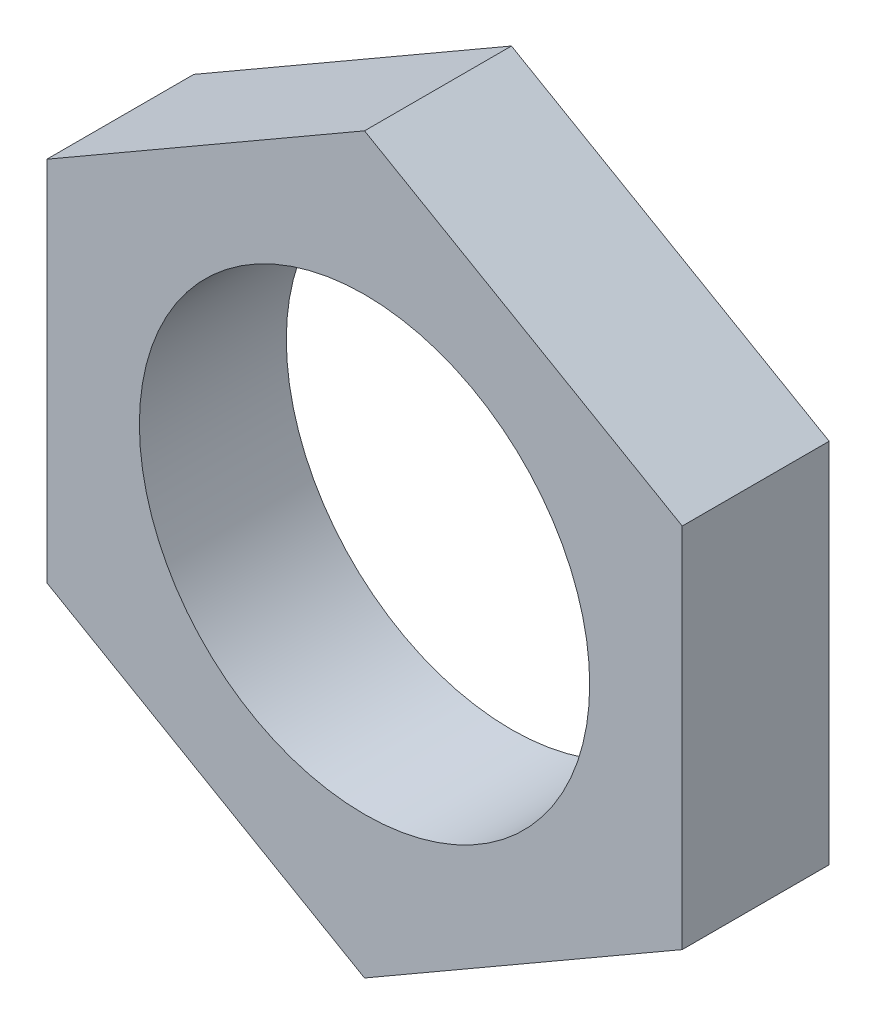
ISO-10303-21;
HEADER;
FILE_DESCRIPTION(('STEP AP214'),'2;1');
FILE_NAME('part.step','',(''),(''),'','','');
FILE_SCHEMA(('AUTOMOTIVE_DESIGN { 1 0 10303 214 1 1 1 1 }'));
ENDSEC;
DATA;
#1=APPLICATION_CONTEXT('core data for automotive mechanical design processes');
#2=APPLICATION_PROTOCOL_DEFINITION('international standard','automotive_design',2000,#1);
#3=PRODUCT_CONTEXT('',#1,'mechanical');
#4=PRODUCT('Part','Part','',(#3));
#5=PRODUCT_RELATED_PRODUCT_CATEGORY('part','',(#4));
#6=PRODUCT_DEFINITION_FORMATION('','',#4);
#7=PRODUCT_DEFINITION_CONTEXT('part definition',#1,'design');
#8=PRODUCT_DEFINITION('design','',#6,#7);
#9=PRODUCT_DEFINITION_SHAPE('','',#8);
#10=(LENGTH_UNIT() NAMED_UNIT(*) SI_UNIT(.MILLI.,.METRE.));
#11=(NAMED_UNIT(*) PLANE_ANGLE_UNIT() SI_UNIT($,.RADIAN.));
#12=(NAMED_UNIT(*) SI_UNIT($,.STERADIAN.) SOLID_ANGLE_UNIT());
#13=UNCERTAINTY_MEASURE_WITH_UNIT(LENGTH_MEASURE(1.E-05),#10,'distance_accuracy_value','');
#14=(GEOMETRIC_REPRESENTATION_CONTEXT(3) GLOBAL_UNCERTAINTY_ASSIGNED_CONTEXT((#13)) GLOBAL_UNIT_ASSIGNED_CONTEXT((#10,
#11,#12)) REPRESENTATION_CONTEXT('',''));
#15=CARTESIAN_POINT('',(0.,0.,0.));
#16=DIRECTION('',(0.,0.,1.));
#17=DIRECTION('',(1.,0.,0.));
#18=AXIS2_PLACEMENT_3D('',#15,#16,#17);
#19=CARTESIAN_POINT('',(0.,0.,2.));
#20=DIRECTION('',(0.,0.,1.));
#21=DIRECTION('',(1.,0.,0.));
#22=AXIS2_PLACEMENT_3D('',#19,#20,#21);
#23=PLANE('',#22);
#24=CARTESIAN_POINT('',(0.,0.,2.));
#25=DIRECTION('',(0.,0.,-1.));
#26=DIRECTION('',(-1.,0.,0.));
#27=AXIS2_PLACEMENT_3D('',#24,#25,#26);
#28=CIRCLE('',#27,2.835);
#29=CARTESIAN_POINT('',(2.835,0.,2.));
#30=VERTEX_POINT('',#29);
#31=EDGE_CURVE('E79',#30,#30,#28,.T.);
#32=ORIENTED_EDGE('',*,*,#31,.F.);
#33=EDGE_LOOP('',(#32));
#34=FACE_BOUND('',#33,.T.);
#35=DIRECTION('',(0.,1.,0.));
#36=VECTOR('',#35,1.);
#37=CARTESIAN_POINT('',(4.,-2.30940107675851,2.));
#38=LINE('',#37,#36);
#39=CARTESIAN_POINT('',(4.,-2.30940107675851,2.));
#40=VERTEX_POINT('',#39);
#41=CARTESIAN_POINT('',(4.,2.3094010767585,2.));
#42=VERTEX_POINT('',#41);
#43=EDGE_CURVE('E28',#40,#42,#38,.T.);
#44=ORIENTED_EDGE('',*,*,#43,.F.);
#45=DIRECTION('',(0.866025403784439,0.5,0.));
#46=VECTOR('',#45,1.);
#47=CARTESIAN_POINT('',(0.,-4.61880215351701,2.));
#48=LINE('',#47,#46);
#49=CARTESIAN_POINT('',(0.,-4.61880215351701,2.));
#50=VERTEX_POINT('',#49);
#51=EDGE_CURVE('E149',#50,#40,#48,.T.);
#52=ORIENTED_EDGE('',*,*,#51,.F.);
#53=DIRECTION('',(0.866025403784438,-0.5,0.));
#54=VECTOR('',#53,1.);
#55=CARTESIAN_POINT('',(-4.,-2.3094010767585,2.));
#56=LINE('',#55,#54);
#57=CARTESIAN_POINT('',(-4.,-2.3094010767585,2.));
#58=VERTEX_POINT('',#57);
#59=EDGE_CURVE('E68',#58,#50,#56,.T.);
#60=ORIENTED_EDGE('',*,*,#59,.F.);
#61=DIRECTION('',(0.,-1.,0.));
#62=VECTOR('',#61,1.);
#63=CARTESIAN_POINT('',(-4.,2.30940107675851,2.));
#64=LINE('',#63,#62);
#65=CARTESIAN_POINT('',(-4.,2.30940107675851,2.));
#66=VERTEX_POINT('',#65);
#67=EDGE_CURVE('E125',#66,#58,#64,.T.);
#68=ORIENTED_EDGE('',*,*,#67,.F.);
#69=DIRECTION('',(-0.866025403784439,-0.5,0.));
#70=VECTOR('',#69,1.);
#71=CARTESIAN_POINT('',(0.,4.61880215351701,2.));
#72=LINE('',#71,#70);
#73=CARTESIAN_POINT('',(0.,4.61880215351701,2.));
#74=VERTEX_POINT('',#73);
#75=EDGE_CURVE('E118',#74,#66,#72,.T.);
#76=ORIENTED_EDGE('',*,*,#75,.F.);
#77=DIRECTION('',(-0.866025403784438,0.5,0.));
#78=VECTOR('',#77,1.);
#79=CARTESIAN_POINT('',(4.,2.3094010767585,2.));
#80=LINE('',#79,#78);
#81=EDGE_CURVE('E103',#42,#74,#80,.T.);
#82=ORIENTED_EDGE('',*,*,#81,.F.);
#83=EDGE_LOOP('',(#44,#52,#60,#68,#76,#82));
#84=FACE_BOUND('',#83,.T.);
#85=ADVANCED_FACE('F17',(#34,#84),#23,.F.);
#86=CARTESIAN_POINT('',(0.,0.,3.85));
#87=DIRECTION('',(0.,0.,1.));
#88=DIRECTION('',(1.,0.,0.));
#89=AXIS2_PLACEMENT_3D('',#86,#87,#88);
#90=PLANE('',#89);
#91=CARTESIAN_POINT('',(0.,0.,3.85));
#92=DIRECTION('',(0.,0.,-1.));
#93=DIRECTION('',(-1.,0.,0.));
#94=AXIS2_PLACEMENT_3D('',#91,#92,#93);
#95=CIRCLE('',#94,2.835);
#96=CARTESIAN_POINT('',(2.835,0.,3.85));
#97=VERTEX_POINT('',#96);
#98=EDGE_CURVE('E140',#97,#97,#95,.T.);
#99=ORIENTED_EDGE('',*,*,#98,.T.);
#100=EDGE_LOOP('',(#99));
#101=FACE_BOUND('',#100,.T.);
#102=DIRECTION('',(0.,1.,0.));
#103=VECTOR('',#102,1.);
#104=CARTESIAN_POINT('',(4.,-2.30940107675851,3.85));
#105=LINE('',#104,#103);
#106=CARTESIAN_POINT('',(4.,-2.30940107675851,3.85));
#107=VERTEX_POINT('',#106);
#108=CARTESIAN_POINT('',(4.,2.3094010767585,3.85));
#109=VERTEX_POINT('',#108);
#110=EDGE_CURVE('E11',#107,#109,#105,.T.);
#111=ORIENTED_EDGE('',*,*,#110,.T.);
#112=DIRECTION('',(-0.866025403784438,0.5,0.));
#113=VECTOR('',#112,1.);
#114=CARTESIAN_POINT('',(4.,2.3094010767585,3.85));
#115=LINE('',#114,#113);
#116=CARTESIAN_POINT('',(0.,4.61880215351701,3.85));
#117=VERTEX_POINT('',#116);
#118=EDGE_CURVE('E113',#109,#117,#115,.T.);
#119=ORIENTED_EDGE('',*,*,#118,.T.);
#120=DIRECTION('',(-0.866025403784439,-0.5,0.));
#121=VECTOR('',#120,1.);
#122=CARTESIAN_POINT('',(0.,4.61880215351701,3.85));
#123=LINE('',#122,#121);
#124=CARTESIAN_POINT('',(-4.,2.30940107675851,3.85));
#125=VERTEX_POINT('',#124);
#126=EDGE_CURVE('E120',#117,#125,#123,.T.);
#127=ORIENTED_EDGE('',*,*,#126,.T.);
#128=DIRECTION('',(0.,-1.,0.));
#129=VECTOR('',#128,1.);
#130=CARTESIAN_POINT('',(-4.,2.30940107675851,3.85));
#131=LINE('',#130,#129);
#132=CARTESIAN_POINT('',(-4.,-2.3094010767585,3.85));
#133=VERTEX_POINT('',#132);
#134=EDGE_CURVE('E135',#125,#133,#131,.T.);
#135=ORIENTED_EDGE('',*,*,#134,.T.);
#136=DIRECTION('',(0.866025403784438,-0.5,0.));
#137=VECTOR('',#136,1.);
#138=CARTESIAN_POINT('',(-4.,-2.3094010767585,3.85));
#139=LINE('',#138,#137);
#140=CARTESIAN_POINT('',(0.,-4.61880215351701,3.85));
#141=VERTEX_POINT('',#140);
#142=EDGE_CURVE('E145',#133,#141,#139,.T.);
#143=ORIENTED_EDGE('',*,*,#142,.T.);
#144=DIRECTION('',(0.866025403784439,0.5,0.));
#145=VECTOR('',#144,1.);
#146=CARTESIAN_POINT('',(0.,-4.61880215351701,3.85));
#147=LINE('',#146,#145);
#148=EDGE_CURVE('E166',#141,#107,#147,.T.);
#149=ORIENTED_EDGE('',*,*,#148,.T.);
#150=EDGE_LOOP('',(#111,#119,#127,#135,#143,#149));
#151=FACE_BOUND('',#150,.T.);
#152=ADVANCED_FACE('F183',(#101,#151),#90,.T.);
#153=CARTESIAN_POINT('',(4.,-2.30940107675851,2.));
#154=DIRECTION('',(1.,0.,0.));
#155=DIRECTION('',(0.,-1.,0.));
#156=AXIS2_PLACEMENT_3D('',#153,#154,#155);
#157=PLANE('',#156);
#158=ORIENTED_EDGE('',*,*,#43,.T.);
#159=DIRECTION('',(0.,0.,1.));
#160=VECTOR('',#159,1.);
#161=CARTESIAN_POINT('',(4.,2.3094010767585,2.));
#162=LINE('',#161,#160);
#163=EDGE_CURVE('E109',#42,#109,#162,.T.);
#164=ORIENTED_EDGE('',*,*,#163,.T.);
#165=ORIENTED_EDGE('',*,*,#110,.F.);
#166=DIRECTION('',(0.,0.,1.));
#167=VECTOR('',#166,1.);
#168=CARTESIAN_POINT('',(4.,-2.30940107675851,2.));
#169=LINE('',#168,#167);
#170=EDGE_CURVE('E152',#40,#107,#169,.T.);
#171=ORIENTED_EDGE('',*,*,#170,.F.);
#172=EDGE_LOOP('',(#158,#164,#165,#171));
#173=FACE_BOUND('',#172,.T.);
#174=ADVANCED_FACE('F193',(#173),#157,.T.);
#175=CARTESIAN_POINT('',(4.,2.3094010767585,2.));
#176=DIRECTION('',(0.5,0.866025403784438,0.));
#177=DIRECTION('',(0.,0.,-1.));
#178=AXIS2_PLACEMENT_3D('',#175,#176,#177);
#179=PLANE('',#178);
#180=ORIENTED_EDGE('',*,*,#81,.T.);
#181=DIRECTION('',(0.,0.,1.));
#182=VECTOR('',#181,1.);
#183=CARTESIAN_POINT('',(0.,4.61880215351701,2.));
#184=LINE('',#183,#182);
#185=EDGE_CURVE('E107',#74,#117,#184,.T.);
#186=ORIENTED_EDGE('',*,*,#185,.T.);
#187=ORIENTED_EDGE('',*,*,#118,.F.);
#188=ORIENTED_EDGE('',*,*,#163,.F.);
#189=EDGE_LOOP('',(#180,#186,#187,#188));
#190=FACE_BOUND('',#189,.T.);
#191=ADVANCED_FACE('F105',(#190),#179,.T.);
#192=CARTESIAN_POINT('',(0.,4.61880215351701,2.));
#193=DIRECTION('',(-0.5,0.866025403784439,0.));
#194=DIRECTION('',(0.,0.,1.));
#195=AXIS2_PLACEMENT_3D('',#192,#193,#194);
#196=PLANE('',#195);
#197=ORIENTED_EDGE('',*,*,#75,.T.);
#198=DIRECTION('',(0.,0.,1.));
#199=VECTOR('',#198,1.);
#200=CARTESIAN_POINT('',(-4.,2.30940107675851,2.));
#201=LINE('',#200,#199);
#202=EDGE_CURVE('E127',#66,#125,#201,.T.);
#203=ORIENTED_EDGE('',*,*,#202,.T.);
#204=ORIENTED_EDGE('',*,*,#126,.F.);
#205=ORIENTED_EDGE('',*,*,#185,.F.);
#206=EDGE_LOOP('',(#197,#203,#204,#205));
#207=FACE_BOUND('',#206,.T.);
#208=ADVANCED_FACE('F116',(#207),#196,.T.);
#209=CARTESIAN_POINT('',(-4.,2.30940107675851,2.));
#210=DIRECTION('',(-1.,0.,0.));
#211=DIRECTION('',(0.,0.,1.));
#212=AXIS2_PLACEMENT_3D('',#209,#210,#211);
#213=PLANE('',#212);
#214=ORIENTED_EDGE('',*,*,#67,.T.);
#215=DIRECTION('',(0.,0.,1.));
#216=VECTOR('',#215,1.);
#217=CARTESIAN_POINT('',(-4.,-2.3094010767585,2.));
#218=LINE('',#217,#216);
#219=EDGE_CURVE('E148',#58,#133,#218,.T.);
#220=ORIENTED_EDGE('',*,*,#219,.T.);
#221=ORIENTED_EDGE('',*,*,#134,.F.);
#222=ORIENTED_EDGE('',*,*,#202,.F.);
#223=EDGE_LOOP('',(#214,#220,#221,#222));
#224=FACE_BOUND('',#223,.T.);
#225=ADVANCED_FACE('F186',(#224),#213,.T.);
#226=CARTESIAN_POINT('',(-4.,-2.3094010767585,2.));
#227=DIRECTION('',(-0.5,-0.866025403784438,0.));
#228=DIRECTION('',(-0.866025403784438,0.5,0.));
#229=AXIS2_PLACEMENT_3D('',#226,#227,#228);
#230=PLANE('',#229);
#231=ORIENTED_EDGE('',*,*,#59,.T.);
#232=DIRECTION('',(0.,0.,1.));
#233=VECTOR('',#232,1.);
#234=CARTESIAN_POINT('',(0.,-4.61880215351701,2.));
#235=LINE('',#234,#233);
#236=EDGE_CURVE('E21',#50,#141,#235,.T.);
#237=ORIENTED_EDGE('',*,*,#236,.T.);
#238=ORIENTED_EDGE('',*,*,#142,.F.);
#239=ORIENTED_EDGE('',*,*,#219,.F.);
#240=EDGE_LOOP('',(#231,#237,#238,#239));
#241=FACE_BOUND('',#240,.T.);
#242=ADVANCED_FACE('F19',(#241),#230,.T.);
#243=CARTESIAN_POINT('',(0.,-4.61880215351701,2.));
#244=DIRECTION('',(0.5,-0.866025403784439,0.));
#245=DIRECTION('',(0.,0.,-1.));
#246=AXIS2_PLACEMENT_3D('',#243,#244,#245);
#247=PLANE('',#246);
#248=ORIENTED_EDGE('',*,*,#51,.T.);
#249=ORIENTED_EDGE('',*,*,#170,.T.);
#250=ORIENTED_EDGE('',*,*,#148,.F.);
#251=ORIENTED_EDGE('',*,*,#236,.F.);
#252=EDGE_LOOP('',(#248,#249,#250,#251));
#253=FACE_BOUND('',#252,.T.);
#254=ADVANCED_FACE('F191',(#253),#247,.T.);
#255=CARTESIAN_POINT('',(0.,0.,2.));
#256=DIRECTION('',(0.,0.,1.));
#257=DIRECTION('',(-1.,0.,0.));
#258=AXIS2_PLACEMENT_3D('',#255,#256,#257);
#259=CYLINDRICAL_SURFACE('',#258,2.835);
#260=ORIENTED_EDGE('',*,*,#98,.F.);
#261=DIRECTION('',(0.,0.,-1.));
#262=VECTOR('',#261,1.);
#263=CARTESIAN_POINT('',(2.835,0.,2.));
#264=LINE('',#263,#262);
#265=EDGE_CURVE('E143',#97,#30,#264,.T.);
#266=ORIENTED_EDGE('',*,*,#265,.T.);
#267=ORIENTED_EDGE('',*,*,#31,.T.);
#268=ORIENTED_EDGE('',*,*,#265,.F.);
#269=EDGE_LOOP('',(#260,#266,#267,#268));
#270=FACE_BOUND('',#269,.T.);
#271=ADVANCED_FACE('F261',(#270),#259,.F.);
#272=CLOSED_SHELL('',(#85,#152,#174,#191,#208,#225,#242,#254,#271));
#273=MANIFOLD_SOLID_BREP('B1',#272);
#274=ADVANCED_BREP_SHAPE_REPRESENTATION('',(#18,#273),#14);
#275=SHAPE_DEFINITION_REPRESENTATION(#9,#274);
ENDSEC;
END-ISO-10303-21;
